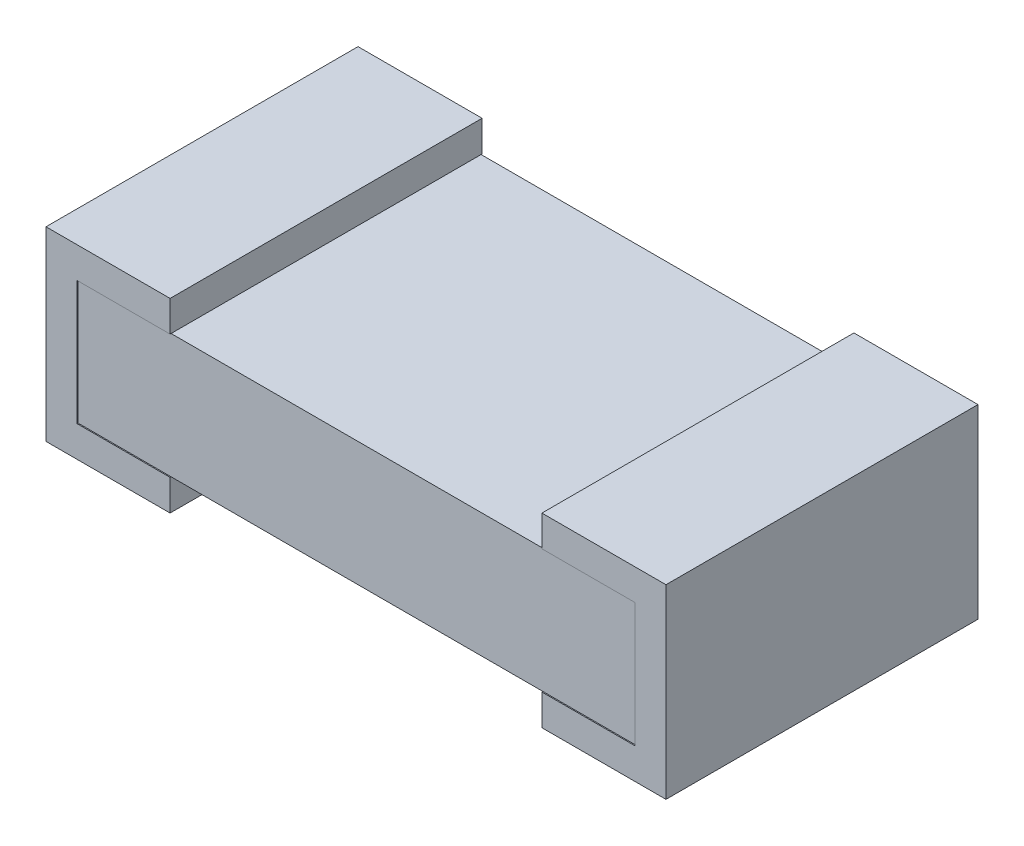
ISO-10303-21;
HEADER;
FILE_DESCRIPTION(('STEP AP214'),'2;1');
FILE_NAME('part.step','',(''),(''),'','','');
FILE_SCHEMA(('AUTOMOTIVE_DESIGN { 1 0 10303 214 1 1 1 1 }'));
ENDSEC;
DATA;
#1=APPLICATION_CONTEXT('core data for automotive mechanical design processes');
#2=APPLICATION_PROTOCOL_DEFINITION('international standard','automotive_design',2000,#1);
#3=PRODUCT_CONTEXT('',#1,'mechanical');
#4=PRODUCT('Part','Part','',(#3));
#5=PRODUCT_RELATED_PRODUCT_CATEGORY('part','',(#4));
#6=PRODUCT_DEFINITION_FORMATION('','',#4);
#7=PRODUCT_DEFINITION_CONTEXT('part definition',#1,'design');
#8=PRODUCT_DEFINITION('design','',#6,#7);
#9=PRODUCT_DEFINITION_SHAPE('','',#8);
#10=(LENGTH_UNIT() NAMED_UNIT(*) SI_UNIT(.MILLI.,.METRE.));
#11=(NAMED_UNIT(*) PLANE_ANGLE_UNIT() SI_UNIT($,.RADIAN.));
#12=(NAMED_UNIT(*) SI_UNIT($,.STERADIAN.) SOLID_ANGLE_UNIT());
#13=UNCERTAINTY_MEASURE_WITH_UNIT(LENGTH_MEASURE(1.E-05),#10,'distance_accuracy_value','');
#14=(GEOMETRIC_REPRESENTATION_CONTEXT(3) GLOBAL_UNCERTAINTY_ASSIGNED_CONTEXT((#13)) GLOBAL_UNIT_ASSIGNED_CONTEXT((#10,
#11,#12)) REPRESENTATION_CONTEXT('',''));
#15=CARTESIAN_POINT('',(0.,0.,0.));
#16=DIRECTION('',(0.,0.,1.));
#17=DIRECTION('',(1.,0.,0.));
#18=AXIS2_PLACEMENT_3D('',#15,#16,#17);
#19=CARTESIAN_POINT('',(-0.686,0.1525,0.381));
#20=DIRECTION('',(0.,-1.,0.));
#21=DIRECTION('',(0.,0.,-1.));
#22=AXIS2_PLACEMENT_3D('',#19,#20,#21);
#23=PLANE('',#22);
#24=DIRECTION('',(-1.,0.,0.));
#25=VECTOR('',#24,1.);
#26=CARTESIAN_POINT('',(-0.686,0.1525,0.381));
#27=LINE('',#26,#25);
#28=CARTESIAN_POINT('',(0.457,0.1525,0.381));
#29=VERTEX_POINT('',#28);
#30=CARTESIAN_POINT('',(-0.457,0.1525,0.381));
#31=VERTEX_POINT('',#30);
#32=EDGE_CURVE('E58',#29,#31,#27,.T.);
#33=ORIENTED_EDGE('',*,*,#32,.F.);
#34=DIRECTION('',(0.,0.,-1.));
#35=VECTOR('',#34,1.);
#36=CARTESIAN_POINT('',(0.457,0.1525,0.3835));
#37=LINE('',#36,#35);
#38=CARTESIAN_POINT('',(0.457,0.1525,-0.381));
#39=VERTEX_POINT('',#38);
#40=EDGE_CURVE('E205',#29,#39,#37,.T.);
#41=ORIENTED_EDGE('',*,*,#40,.T.);
#42=DIRECTION('',(-1.,0.,0.));
#43=VECTOR('',#42,1.);
#44=CARTESIAN_POINT('',(-0.686,0.1525,-0.381));
#45=LINE('',#44,#43);
#46=CARTESIAN_POINT('',(-0.457,0.1525,-0.381));
#47=VERTEX_POINT('',#46);
#48=EDGE_CURVE('E369',#39,#47,#45,.T.);
#49=ORIENTED_EDGE('',*,*,#48,.T.);
#50=DIRECTION('',(0.,0.,-1.));
#51=VECTOR('',#50,1.);
#52=CARTESIAN_POINT('',(-0.457,0.1525,0.3835));
#53=LINE('',#52,#51);
#54=EDGE_CURVE('E328',#31,#47,#53,.T.);
#55=ORIENTED_EDGE('',*,*,#54,.F.);
#56=EDGE_LOOP('',(#33,#41,#49,#55));
#57=FACE_BOUND('',#56,.T.);
#58=ADVANCED_FACE('F34',(#57),#23,.F.);
#59=CARTESIAN_POINT('',(-0.686,-0.1525,0.381));
#60=DIRECTION('',(0.,1.,0.));
#61=DIRECTION('',(0.,0.,1.));
#62=AXIS2_PLACEMENT_3D('',#59,#60,#61);
#63=PLANE('',#62);
#64=DIRECTION('',(1.,0.,0.));
#65=VECTOR('',#64,1.);
#66=CARTESIAN_POINT('',(-0.686,-0.1525,-0.381));
#67=LINE('',#66,#65);
#68=CARTESIAN_POINT('',(-0.457,-0.1525,-0.381));
#69=VERTEX_POINT('',#68);
#70=CARTESIAN_POINT('',(0.457,-0.1525,-0.381));
#71=VERTEX_POINT('',#70);
#72=EDGE_CURVE('E376',#69,#71,#67,.T.);
#73=ORIENTED_EDGE('',*,*,#72,.T.);
#74=DIRECTION('',(0.,0.,-1.));
#75=VECTOR('',#74,1.);
#76=CARTESIAN_POINT('',(0.457,-0.1525,0.3835));
#77=LINE('',#76,#75);
#78=CARTESIAN_POINT('',(0.457,-0.1525,0.381));
#79=VERTEX_POINT('',#78);
#80=EDGE_CURVE('E50',#79,#71,#77,.T.);
#81=ORIENTED_EDGE('',*,*,#80,.F.);
#82=DIRECTION('',(1.,0.,0.));
#83=VECTOR('',#82,1.);
#84=CARTESIAN_POINT('',(-0.686,-0.1525,0.381));
#85=LINE('',#84,#83);
#86=CARTESIAN_POINT('',(-0.457,-0.1525,0.381));
#87=VERTEX_POINT('',#86);
#88=EDGE_CURVE('E42',#87,#79,#85,.T.);
#89=ORIENTED_EDGE('',*,*,#88,.F.);
#90=DIRECTION('',(0.,0.,-1.));
#91=VECTOR('',#90,1.);
#92=CARTESIAN_POINT('',(-0.457,-0.1525,0.3835));
#93=LINE('',#92,#91);
#94=EDGE_CURVE('E341',#87,#69,#93,.T.);
#95=ORIENTED_EDGE('',*,*,#94,.T.);
#96=EDGE_LOOP('',(#73,#81,#89,#95));
#97=FACE_BOUND('',#96,.T.);
#98=ADVANCED_FACE('F392',(#97),#63,.F.);
#99=CARTESIAN_POINT('',(0.686,0.1525,0.381));
#100=DIRECTION('',(0.,0.,-1.));
#101=DIRECTION('',(-1.,0.,0.));
#102=AXIS2_PLACEMENT_3D('',#99,#100,#101);
#103=PLANE('',#102);
#104=DIRECTION('',(0.,1.,0.));
#105=VECTOR('',#104,1.);
#106=CARTESIAN_POINT('',(0.686,-0.1525,0.381));
#107=LINE('',#106,#105);
#108=CARTESIAN_POINT('',(0.686,-0.1525,0.381));
#109=VERTEX_POINT('',#108);
#110=CARTESIAN_POINT('',(0.686,0.1525,0.381));
#111=VERTEX_POINT('',#110);
#112=EDGE_CURVE('E357',#109,#111,#107,.T.);
#113=ORIENTED_EDGE('',*,*,#112,.T.);
#114=EDGE_CURVE('E359',#111,#29,#27,.T.);
#115=ORIENTED_EDGE('',*,*,#114,.T.);
#116=ORIENTED_EDGE('',*,*,#32,.T.);
#117=DIRECTION('',(1.,0.,0.));
#118=VECTOR('',#117,1.);
#119=CARTESIAN_POINT('',(0.686,0.1525,0.381));
#120=LINE('',#119,#118);
#121=CARTESIAN_POINT('',(-0.686,0.1525,0.381));
#122=VERTEX_POINT('',#121);
#123=EDGE_CURVE('E353',#122,#31,#120,.T.);
#124=ORIENTED_EDGE('',*,*,#123,.F.);
#125=DIRECTION('',(0.,-1.,0.));
#126=VECTOR('',#125,1.);
#127=CARTESIAN_POINT('',(-0.686,-0.1525,0.381));
#128=LINE('',#127,#126);
#129=CARTESIAN_POINT('',(-0.686,-0.1525,0.381));
#130=VERTEX_POINT('',#129);
#131=EDGE_CURVE('E361',#122,#130,#128,.T.);
#132=ORIENTED_EDGE('',*,*,#131,.T.);
#133=EDGE_CURVE('E11',#130,#87,#85,.T.);
#134=ORIENTED_EDGE('',*,*,#133,.T.);
#135=ORIENTED_EDGE('',*,*,#88,.T.);
#136=DIRECTION('',(1.,0.,0.));
#137=VECTOR('',#136,1.);
#138=CARTESIAN_POINT('',(0.686,-0.1525,0.381));
#139=LINE('',#138,#137);
#140=EDGE_CURVE('E209',#79,#109,#139,.T.);
#141=ORIENTED_EDGE('',*,*,#140,.T.);
#142=EDGE_LOOP('',(#113,#115,#116,#124,#132,#134,#135,#141));
#143=FACE_BOUND('',#142,.T.);
#144=ADVANCED_FACE('F419',(#143),#103,.F.);
#145=CARTESIAN_POINT('',(0.686,0.1525,-0.381));
#146=DIRECTION('',(0.,0.,-1.));
#147=DIRECTION('',(-1.,0.,0.));
#148=AXIS2_PLACEMENT_3D('',#145,#146,#147);
#149=PLANE('',#148);
#150=DIRECTION('',(0.,1.,0.));
#151=VECTOR('',#150,1.);
#152=CARTESIAN_POINT('',(0.686,-0.1525,-0.381));
#153=LINE('',#152,#151);
#154=CARTESIAN_POINT('',(0.686,-0.1525,-0.381));
#155=VERTEX_POINT('',#154);
#156=CARTESIAN_POINT('',(0.686,0.1525,-0.381));
#157=VERTEX_POINT('',#156);
#158=EDGE_CURVE('E356',#155,#157,#153,.T.);
#159=ORIENTED_EDGE('',*,*,#158,.F.);
#160=EDGE_CURVE('E371',#71,#155,#67,.T.);
#161=ORIENTED_EDGE('',*,*,#160,.F.);
#162=ORIENTED_EDGE('',*,*,#72,.F.);
#163=CARTESIAN_POINT('',(-0.686,-0.1525,-0.381));
#164=VERTEX_POINT('',#163);
#165=EDGE_CURVE('E37',#164,#69,#67,.T.);
#166=ORIENTED_EDGE('',*,*,#165,.F.);
#167=DIRECTION('',(0.,-1.,0.));
#168=VECTOR('',#167,1.);
#169=CARTESIAN_POINT('',(-0.686,-0.1525,-0.381));
#170=LINE('',#169,#168);
#171=CARTESIAN_POINT('',(-0.686,0.1525,-0.381));
#172=VERTEX_POINT('',#171);
#173=EDGE_CURVE('E368',#172,#164,#170,.T.);
#174=ORIENTED_EDGE('',*,*,#173,.F.);
#175=EDGE_CURVE('E365',#47,#172,#45,.T.);
#176=ORIENTED_EDGE('',*,*,#175,.F.);
#177=ORIENTED_EDGE('',*,*,#48,.F.);
#178=EDGE_CURVE('E366',#157,#39,#45,.T.);
#179=ORIENTED_EDGE('',*,*,#178,.F.);
#180=EDGE_LOOP('',(#159,#161,#162,#166,#174,#176,#177,#179));
#181=FACE_BOUND('',#180,.T.);
#182=ADVANCED_FACE('F393',(#181),#149,.T.);
#183=CARTESIAN_POINT('',(-0.686,-0.1525,0.3835));
#184=DIRECTION('',(0.,-1.,0.));
#185=DIRECTION('',(0.,0.,-1.));
#186=AXIS2_PLACEMENT_3D('',#183,#184,#185);
#187=PLANE('',#186);
#188=CARTESIAN_POINT('',(-0.457,-0.1525,0.3835));
#189=VERTEX_POINT('',#188);
#190=EDGE_CURVE('E337',#189,#87,#93,.T.);
#191=ORIENTED_EDGE('',*,*,#190,.T.);
#192=ORIENTED_EDGE('',*,*,#133,.F.);
#193=DIRECTION('',(0.,0.,-1.));
#194=VECTOR('',#193,1.);
#195=CARTESIAN_POINT('',(-0.686,-0.1525,0.3835));
#196=LINE('',#195,#194);
#197=CARTESIAN_POINT('',(-0.686,-0.1525,0.3835));
#198=VERTEX_POINT('',#197);
#199=EDGE_CURVE('E333',#198,#130,#196,.T.);
#200=ORIENTED_EDGE('',*,*,#199,.F.);
#201=DIRECTION('',(-1.,0.,0.));
#202=VECTOR('',#201,1.);
#203=CARTESIAN_POINT('',(-0.686,-0.1525,0.3835));
#204=LINE('',#203,#202);
#205=EDGE_CURVE('E298',#189,#198,#204,.T.);
#206=ORIENTED_EDGE('',*,*,#205,.F.);
#207=EDGE_LOOP('',(#191,#192,#200,#206));
#208=FACE_BOUND('',#207,.T.);
#209=ADVANCED_FACE('F424',(#208),#187,.F.);
#210=CARTESIAN_POINT('',(-0.686,0.1525,0.3835));
#211=DIRECTION('',(-1.,0.,0.));
#212=DIRECTION('',(0.,0.,1.));
#213=AXIS2_PLACEMENT_3D('',#210,#211,#212);
#214=PLANE('',#213);
#215=ORIENTED_EDGE('',*,*,#199,.T.);
#216=ORIENTED_EDGE('',*,*,#131,.F.);
#217=DIRECTION('',(0.,0.,-1.));
#218=VECTOR('',#217,1.);
#219=CARTESIAN_POINT('',(-0.686,0.1525,0.3835));
#220=LINE('',#219,#218);
#221=CARTESIAN_POINT('',(-0.686,0.1525,0.3835));
#222=VERTEX_POINT('',#221);
#223=EDGE_CURVE('E329',#222,#122,#220,.T.);
#224=ORIENTED_EDGE('',*,*,#223,.F.);
#225=DIRECTION('',(0.,1.,0.));
#226=VECTOR('',#225,1.);
#227=CARTESIAN_POINT('',(-0.686,0.1525,0.3835));
#228=LINE('',#227,#226);
#229=EDGE_CURVE('E300',#198,#222,#228,.T.);
#230=ORIENTED_EDGE('',*,*,#229,.F.);
#231=EDGE_LOOP('',(#215,#216,#224,#230));
#232=FACE_BOUND('',#231,.T.);
#233=ADVANCED_FACE('F428',(#232),#214,.F.);
#234=CARTESIAN_POINT('',(-0.457,0.1525,0.3835));
#235=DIRECTION('',(0.,1.,0.));
#236=DIRECTION('',(0.,0.,1.));
#237=AXIS2_PLACEMENT_3D('',#234,#235,#236);
#238=PLANE('',#237);
#239=ORIENTED_EDGE('',*,*,#223,.T.);
#240=ORIENTED_EDGE('',*,*,#123,.T.);
#241=CARTESIAN_POINT('',(-0.457,0.1525,0.3835));
#242=VERTEX_POINT('',#241);
#243=EDGE_CURVE('E324',#242,#31,#53,.T.);
#244=ORIENTED_EDGE('',*,*,#243,.F.);
#245=DIRECTION('',(1.,0.,0.));
#246=VECTOR('',#245,1.);
#247=CARTESIAN_POINT('',(-0.457,0.1525,0.3835));
#248=LINE('',#247,#246);
#249=EDGE_CURVE('E302',#222,#242,#248,.T.);
#250=ORIENTED_EDGE('',*,*,#249,.F.);
#251=EDGE_LOOP('',(#239,#240,#244,#250));
#252=FACE_BOUND('',#251,.T.);
#253=ADVANCED_FACE('F454',(#252),#238,.F.);
#254=CARTESIAN_POINT('',(-0.457,0.2285,0.3835));
#255=DIRECTION('',(-1.,0.,0.));
#256=DIRECTION('',(0.,-1.,0.));
#257=AXIS2_PLACEMENT_3D('',#254,#255,#256);
#258=PLANE('',#257);
#259=DIRECTION('',(0.,1.,0.));
#260=VECTOR('',#259,1.);
#261=CARTESIAN_POINT('',(-0.457,0.2285,-0.3835));
#262=LINE('',#261,#260);
#263=CARTESIAN_POINT('',(-0.457,0.1525,-0.3835));
#264=VERTEX_POINT('',#263);
#265=CARTESIAN_POINT('',(-0.457,0.2285,-0.3835));
#266=VERTEX_POINT('',#265);
#267=EDGE_CURVE('E285',#264,#266,#262,.T.);
#268=ORIENTED_EDGE('',*,*,#267,.T.);
#269=DIRECTION('',(0.,0.,-1.));
#270=VECTOR('',#269,1.);
#271=CARTESIAN_POINT('',(-0.457,0.2285,0.3835));
#272=LINE('',#271,#270);
#273=CARTESIAN_POINT('',(-0.457,0.2285,0.3835));
#274=VERTEX_POINT('',#273);
#275=EDGE_CURVE('E350',#274,#266,#272,.T.);
#276=ORIENTED_EDGE('',*,*,#275,.F.);
#277=DIRECTION('',(0.,1.,0.));
#278=VECTOR('',#277,1.);
#279=CARTESIAN_POINT('',(-0.457,0.2285,0.3835));
#280=LINE('',#279,#278);
#281=EDGE_CURVE('E286',#242,#274,#280,.T.);
#282=ORIENTED_EDGE('',*,*,#281,.F.);
#283=ORIENTED_EDGE('',*,*,#243,.T.);
#284=ORIENTED_EDGE('',*,*,#54,.T.);
#285=EDGE_CURVE('E304',#47,#264,#53,.T.);
#286=ORIENTED_EDGE('',*,*,#285,.T.);
#287=EDGE_LOOP('',(#268,#276,#282,#283,#284,#286));
#288=FACE_BOUND('',#287,.T.);
#289=ADVANCED_FACE('F456',(#288),#258,.F.);
#290=CARTESIAN_POINT('',(-0.762,0.2285,0.3835));
#291=DIRECTION('',(0.,-1.,0.));
#292=DIRECTION('',(0.,0.,-1.));
#293=AXIS2_PLACEMENT_3D('',#290,#291,#292);
#294=PLANE('',#293);
#295=DIRECTION('',(-1.,0.,0.));
#296=VECTOR('',#295,1.);
#297=CARTESIAN_POINT('',(-0.762,0.2285,-0.3835));
#298=LINE('',#297,#296);
#299=CARTESIAN_POINT('',(-0.762,0.2285,-0.3835));
#300=VERTEX_POINT('',#299);
#301=EDGE_CURVE('E307',#266,#300,#298,.T.);
#302=ORIENTED_EDGE('',*,*,#301,.T.);
#303=DIRECTION('',(0.,0.,-1.));
#304=VECTOR('',#303,1.);
#305=CARTESIAN_POINT('',(-0.762,0.2285,0.3835));
#306=LINE('',#305,#304);
#307=CARTESIAN_POINT('',(-0.762,0.2285,0.3835));
#308=VERTEX_POINT('',#307);
#309=EDGE_CURVE('E347',#308,#300,#306,.T.);
#310=ORIENTED_EDGE('',*,*,#309,.F.);
#311=DIRECTION('',(-1.,0.,0.));
#312=VECTOR('',#311,1.);
#313=CARTESIAN_POINT('',(-0.762,0.2285,0.3835));
#314=LINE('',#313,#312);
#315=EDGE_CURVE('E289',#274,#308,#314,.T.);
#316=ORIENTED_EDGE('',*,*,#315,.F.);
#317=ORIENTED_EDGE('',*,*,#275,.T.);
#318=EDGE_LOOP('',(#302,#310,#316,#317));
#319=FACE_BOUND('',#318,.T.);
#320=ADVANCED_FACE('F462',(#319),#294,.F.);
#321=CARTESIAN_POINT('',(-0.762,-0.2285,0.3835));
#322=DIRECTION('',(1.,0.,0.));
#323=DIRECTION('',(0.,0.,-1.));
#324=AXIS2_PLACEMENT_3D('',#321,#322,#323);
#325=PLANE('',#324);
#326=DIRECTION('',(0.,-1.,0.));
#327=VECTOR('',#326,1.);
#328=CARTESIAN_POINT('',(-0.762,-0.2285,-0.3835));
#329=LINE('',#328,#327);
#330=CARTESIAN_POINT('',(-0.762,-0.2285,-0.3835));
#331=VERTEX_POINT('',#330);
#332=EDGE_CURVE('E309',#300,#331,#329,.T.);
#333=ORIENTED_EDGE('',*,*,#332,.T.);
#334=DIRECTION('',(0.,0.,-1.));
#335=VECTOR('',#334,1.);
#336=CARTESIAN_POINT('',(-0.762,-0.2285,0.3835));
#337=LINE('',#336,#335);
#338=CARTESIAN_POINT('',(-0.762,-0.2285,0.3835));
#339=VERTEX_POINT('',#338);
#340=EDGE_CURVE('E344',#339,#331,#337,.T.);
#341=ORIENTED_EDGE('',*,*,#340,.F.);
#342=DIRECTION('',(0.,-1.,0.));
#343=VECTOR('',#342,1.);
#344=CARTESIAN_POINT('',(-0.762,-0.2285,0.3835));
#345=LINE('',#344,#343);
#346=EDGE_CURVE('E292',#308,#339,#345,.T.);
#347=ORIENTED_EDGE('',*,*,#346,.F.);
#348=ORIENTED_EDGE('',*,*,#309,.T.);
#349=EDGE_LOOP('',(#333,#341,#347,#348));
#350=FACE_BOUND('',#349,.T.);
#351=ADVANCED_FACE('F464',(#350),#325,.F.);
#352=CARTESIAN_POINT('',(-0.457,-0.2285,0.3835));
#353=DIRECTION('',(0.,1.,0.));
#354=DIRECTION('',(-1.,0.,0.));
#355=AXIS2_PLACEMENT_3D('',#352,#353,#354);
#356=PLANE('',#355);
#357=DIRECTION('',(1.,0.,0.));
#358=VECTOR('',#357,1.);
#359=CARTESIAN_POINT('',(-0.457,-0.2285,-0.3835));
#360=LINE('',#359,#358);
#361=CARTESIAN_POINT('',(-0.457,-0.2285,-0.3835));
#362=VERTEX_POINT('',#361);
#363=EDGE_CURVE('E311',#331,#362,#360,.T.);
#364=ORIENTED_EDGE('',*,*,#363,.T.);
#365=DIRECTION('',(0.,0.,-1.));
#366=VECTOR('',#365,1.);
#367=CARTESIAN_POINT('',(-0.457,-0.2285,0.3835));
#368=LINE('',#367,#366);
#369=CARTESIAN_POINT('',(-0.457,-0.2285,0.3835));
#370=VERTEX_POINT('',#369);
#371=EDGE_CURVE('E340',#370,#362,#368,.T.);
#372=ORIENTED_EDGE('',*,*,#371,.F.);
#373=DIRECTION('',(1.,0.,0.));
#374=VECTOR('',#373,1.);
#375=CARTESIAN_POINT('',(-0.457,-0.2285,0.3835));
#376=LINE('',#375,#374);
#377=EDGE_CURVE('E294',#339,#370,#376,.T.);
#378=ORIENTED_EDGE('',*,*,#377,.F.);
#379=ORIENTED_EDGE('',*,*,#340,.T.);
#380=EDGE_LOOP('',(#364,#372,#378,#379));
#381=FACE_BOUND('',#380,.T.);
#382=ADVANCED_FACE('F465',(#381),#356,.F.);
#383=CARTESIAN_POINT('',(-0.457,-0.1525,0.3835));
#384=DIRECTION('',(-1.,0.,0.));
#385=DIRECTION('',(0.,-1.,0.));
#386=AXIS2_PLACEMENT_3D('',#383,#384,#385);
#387=PLANE('',#386);
#388=DIRECTION('',(0.,1.,0.));
#389=VECTOR('',#388,1.);
#390=CARTESIAN_POINT('',(-0.457,-0.1525,-0.3835));
#391=LINE('',#390,#389);
#392=CARTESIAN_POINT('',(-0.457,-0.1525,-0.3835));
#393=VERTEX_POINT('',#392);
#394=EDGE_CURVE('E313',#362,#393,#391,.T.);
#395=ORIENTED_EDGE('',*,*,#394,.T.);
#396=EDGE_CURVE('E336',#69,#393,#93,.T.);
#397=ORIENTED_EDGE('',*,*,#396,.F.);
#398=ORIENTED_EDGE('',*,*,#94,.F.);
#399=ORIENTED_EDGE('',*,*,#190,.F.);
#400=DIRECTION('',(0.,1.,0.));
#401=VECTOR('',#400,1.);
#402=CARTESIAN_POINT('',(-0.457,-0.1525,0.3835));
#403=LINE('',#402,#401);
#404=EDGE_CURVE('E296',#370,#189,#403,.T.);
#405=ORIENTED_EDGE('',*,*,#404,.F.);
#406=ORIENTED_EDGE('',*,*,#371,.T.);
#407=EDGE_LOOP('',(#395,#397,#398,#399,#405,#406));
#408=FACE_BOUND('',#407,.T.);
#409=ADVANCED_FACE('F388',(#408),#387,.F.);
#410=ORIENTED_EDGE('',*,*,#165,.T.);
#411=ORIENTED_EDGE('',*,*,#396,.T.);
#412=DIRECTION('',(-1.,0.,0.));
#413=VECTOR('',#412,1.);
#414=CARTESIAN_POINT('',(-0.686,-0.1525,-0.3835));
#415=LINE('',#414,#413);
#416=CARTESIAN_POINT('',(-0.686,-0.1525,-0.3835));
#417=VERTEX_POINT('',#416);
#418=EDGE_CURVE('E316',#393,#417,#415,.T.);
#419=ORIENTED_EDGE('',*,*,#418,.T.);
#420=EDGE_CURVE('E332',#164,#417,#196,.T.);
#421=ORIENTED_EDGE('',*,*,#420,.F.);
#422=EDGE_LOOP('',(#410,#411,#419,#421));
#423=FACE_BOUND('',#422,.T.);
#424=ADVANCED_FACE('F383',(#423),#187,.F.);
#425=ORIENTED_EDGE('',*,*,#173,.T.);
#426=ORIENTED_EDGE('',*,*,#420,.T.);
#427=DIRECTION('',(0.,1.,0.));
#428=VECTOR('',#427,1.);
#429=CARTESIAN_POINT('',(-0.686,0.1525,-0.3835));
#430=LINE('',#429,#428);
#431=CARTESIAN_POINT('',(-0.686,0.1525,-0.3835));
#432=VERTEX_POINT('',#431);
#433=EDGE_CURVE('E319',#417,#432,#430,.T.);
#434=ORIENTED_EDGE('',*,*,#433,.T.);
#435=EDGE_CURVE('E327',#172,#432,#220,.T.);
#436=ORIENTED_EDGE('',*,*,#435,.F.);
#437=EDGE_LOOP('',(#425,#426,#434,#436));
#438=FACE_BOUND('',#437,.T.);
#439=ADVANCED_FACE('F445',(#438),#214,.F.);
#440=ORIENTED_EDGE('',*,*,#175,.T.);
#441=ORIENTED_EDGE('',*,*,#435,.T.);
#442=DIRECTION('',(1.,0.,0.));
#443=VECTOR('',#442,1.);
#444=CARTESIAN_POINT('',(-0.457,0.1525,-0.3835));
#445=LINE('',#444,#443);
#446=EDGE_CURVE('E290',#432,#264,#445,.T.);
#447=ORIENTED_EDGE('',*,*,#446,.T.);
#448=ORIENTED_EDGE('',*,*,#285,.F.);
#449=EDGE_LOOP('',(#440,#441,#447,#448));
#450=FACE_BOUND('',#449,.T.);
#451=ADVANCED_FACE('F448',(#450),#238,.F.);
#452=CARTESIAN_POINT('',(-0.457,0.1525,0.3835));
#453=DIRECTION('',(0.,0.,-1.));
#454=DIRECTION('',(-1.,0.,0.));
#455=AXIS2_PLACEMENT_3D('',#452,#453,#454);
#456=PLANE('',#455);
#457=ORIENTED_EDGE('',*,*,#281,.T.);
#458=ORIENTED_EDGE('',*,*,#315,.T.);
#459=ORIENTED_EDGE('',*,*,#346,.T.);
#460=ORIENTED_EDGE('',*,*,#377,.T.);
#461=ORIENTED_EDGE('',*,*,#404,.T.);
#462=ORIENTED_EDGE('',*,*,#205,.T.);
#463=ORIENTED_EDGE('',*,*,#229,.T.);
#464=ORIENTED_EDGE('',*,*,#249,.T.);
#465=EDGE_LOOP('',(#457,#458,#459,#460,#461,#462,#463,#464));
#466=FACE_BOUND('',#465,.T.);
#467=ADVANCED_FACE('F432',(#466),#456,.F.);
#468=CARTESIAN_POINT('',(-0.457,0.1525,-0.3835));
#469=DIRECTION('',(0.,0.,-1.));
#470=DIRECTION('',(-1.,0.,0.));
#471=AXIS2_PLACEMENT_3D('',#468,#469,#470);
#472=PLANE('',#471);
#473=ORIENTED_EDGE('',*,*,#267,.F.);
#474=ORIENTED_EDGE('',*,*,#446,.F.);
#475=ORIENTED_EDGE('',*,*,#433,.F.);
#476=ORIENTED_EDGE('',*,*,#418,.F.);
#477=ORIENTED_EDGE('',*,*,#394,.F.);
#478=ORIENTED_EDGE('',*,*,#363,.F.);
#479=ORIENTED_EDGE('',*,*,#332,.F.);
#480=ORIENTED_EDGE('',*,*,#301,.F.);
#481=EDGE_LOOP('',(#473,#474,#475,#476,#477,#478,#479,#480));
#482=FACE_BOUND('',#481,.T.);
#483=ADVANCED_FACE('F441',(#482),#472,.T.);
#484=CARTESIAN_POINT('',(0.457,0.1525,0.3835));
#485=DIRECTION('',(0.,-1.,0.));
#486=DIRECTION('',(0.,0.,-1.));
#487=AXIS2_PLACEMENT_3D('',#484,#485,#486);
#488=PLANE('',#487);
#489=ORIENTED_EDGE('',*,*,#114,.F.);
#490=DIRECTION('',(0.,0.,-1.));
#491=VECTOR('',#490,1.);
#492=CARTESIAN_POINT('',(0.686,0.1525,0.3835));
#493=LINE('',#492,#491);
#494=CARTESIAN_POINT('',(0.686,0.1525,0.3835));
#495=VERTEX_POINT('',#494);
#496=EDGE_CURVE('E225',#495,#111,#493,.T.);
#497=ORIENTED_EDGE('',*,*,#496,.F.);
#498=DIRECTION('',(-1.,0.,0.));
#499=VECTOR('',#498,1.);
#500=CARTESIAN_POINT('',(0.457,0.1525,0.3835));
#501=LINE('',#500,#499);
#502=CARTESIAN_POINT('',(0.457,0.1525,0.3835));
#503=VERTEX_POINT('',#502);
#504=EDGE_CURVE('E216',#495,#503,#501,.T.);
#505=ORIENTED_EDGE('',*,*,#504,.T.);
#506=EDGE_CURVE('E198',#503,#29,#37,.T.);
#507=ORIENTED_EDGE('',*,*,#506,.T.);
#508=EDGE_LOOP('',(#489,#497,#505,#507));
#509=FACE_BOUND('',#508,.T.);
#510=ADVANCED_FACE('F223',(#509),#488,.T.);
#511=CARTESIAN_POINT('',(0.686,0.1525,0.3835));
#512=DIRECTION('',(-1.,0.,0.));
#513=DIRECTION('',(0.,0.,1.));
#514=AXIS2_PLACEMENT_3D('',#511,#512,#513);
#515=PLANE('',#514);
#516=ORIENTED_EDGE('',*,*,#112,.F.);
#517=DIRECTION('',(0.,0.,-1.));
#518=VECTOR('',#517,1.);
#519=CARTESIAN_POINT('',(0.686,-0.1525,0.3835));
#520=LINE('',#519,#518);
#521=CARTESIAN_POINT('',(0.686,-0.1525,0.3835));
#522=VERTEX_POINT('',#521);
#523=EDGE_CURVE('E279',#522,#109,#520,.T.);
#524=ORIENTED_EDGE('',*,*,#523,.F.);
#525=DIRECTION('',(0.,1.,0.));
#526=VECTOR('',#525,1.);
#527=CARTESIAN_POINT('',(0.686,0.1525,0.3835));
#528=LINE('',#527,#526);
#529=EDGE_CURVE('E226',#522,#495,#528,.T.);
#530=ORIENTED_EDGE('',*,*,#529,.T.);
#531=ORIENTED_EDGE('',*,*,#496,.T.);
#532=EDGE_LOOP('',(#516,#524,#530,#531));
#533=FACE_BOUND('',#532,.T.);
#534=ADVANCED_FACE('F417',(#533),#515,.T.);
#535=CARTESIAN_POINT('',(0.686,-0.1525,0.3835));
#536=DIRECTION('',(0.,1.,0.));
#537=DIRECTION('',(0.,0.,1.));
#538=AXIS2_PLACEMENT_3D('',#535,#536,#537);
#539=PLANE('',#538);
#540=ORIENTED_EDGE('',*,*,#140,.F.);
#541=CARTESIAN_POINT('',(0.457,-0.1525,0.3835));
#542=VERTEX_POINT('',#541);
#543=EDGE_CURVE('E275',#542,#79,#77,.T.);
#544=ORIENTED_EDGE('',*,*,#543,.F.);
#545=DIRECTION('',(1.,0.,0.));
#546=VECTOR('',#545,1.);
#547=CARTESIAN_POINT('',(0.686,-0.1525,0.3835));
#548=LINE('',#547,#546);
#549=EDGE_CURVE('E228',#542,#522,#548,.T.);
#550=ORIENTED_EDGE('',*,*,#549,.T.);
#551=ORIENTED_EDGE('',*,*,#523,.T.);
#552=EDGE_LOOP('',(#540,#544,#550,#551));
#553=FACE_BOUND('',#552,.T.);
#554=ADVANCED_FACE('F413',(#553),#539,.T.);
#555=CARTESIAN_POINT('',(0.457,0.2285,0.3835));
#556=DIRECTION('',(-1.,0.,0.));
#557=DIRECTION('',(0.,-1.,0.));
#558=AXIS2_PLACEMENT_3D('',#555,#556,#557);
#559=PLANE('',#558);
#560=DIRECTION('',(0.,1.,0.));
#561=VECTOR('',#560,1.);
#562=CARTESIAN_POINT('',(0.457,0.2285,-0.3835));
#563=LINE('',#562,#561);
#564=CARTESIAN_POINT('',(0.457,0.1525,-0.3835));
#565=VERTEX_POINT('',#564);
#566=CARTESIAN_POINT('',(0.457,0.2285,-0.3835));
#567=VERTEX_POINT('',#566);
#568=EDGE_CURVE('E244',#565,#567,#563,.T.);
#569=ORIENTED_EDGE('',*,*,#568,.F.);
#570=EDGE_CURVE('E211',#39,#565,#37,.T.);
#571=ORIENTED_EDGE('',*,*,#570,.F.);
#572=ORIENTED_EDGE('',*,*,#40,.F.);
#573=ORIENTED_EDGE('',*,*,#506,.F.);
#574=DIRECTION('',(0.,1.,0.));
#575=VECTOR('',#574,1.);
#576=CARTESIAN_POINT('',(0.457,0.2285,0.3835));
#577=LINE('',#576,#575);
#578=CARTESIAN_POINT('',(0.457,0.2285,0.3835));
#579=VERTEX_POINT('',#578);
#580=EDGE_CURVE('E202',#503,#579,#577,.T.);
#581=ORIENTED_EDGE('',*,*,#580,.T.);
#582=DIRECTION('',(0.,0.,-1.));
#583=VECTOR('',#582,1.);
#584=CARTESIAN_POINT('',(0.457,0.2285,0.3835));
#585=LINE('',#584,#583);
#586=EDGE_CURVE('E243',#579,#567,#585,.T.);
#587=ORIENTED_EDGE('',*,*,#586,.T.);
#588=EDGE_LOOP('',(#569,#571,#572,#573,#581,#587));
#589=FACE_BOUND('',#588,.T.);
#590=ADVANCED_FACE('F201',(#589),#559,.T.);
#591=CARTESIAN_POINT('',(0.686,0.1525,-0.3835));
#592=VERTEX_POINT('',#591);
#593=EDGE_CURVE('E282',#157,#592,#493,.T.);
#594=ORIENTED_EDGE('',*,*,#593,.F.);
#595=ORIENTED_EDGE('',*,*,#178,.T.);
#596=ORIENTED_EDGE('',*,*,#570,.T.);
#597=DIRECTION('',(-1.,0.,0.));
#598=VECTOR('',#597,1.);
#599=CARTESIAN_POINT('',(0.457,0.1525,-0.3835));
#600=LINE('',#599,#598);
#601=EDGE_CURVE('E247',#592,#565,#600,.T.);
#602=ORIENTED_EDGE('',*,*,#601,.F.);
#603=EDGE_LOOP('',(#594,#595,#596,#602));
#604=FACE_BOUND('',#603,.T.);
#605=ADVANCED_FACE('F401',(#604),#488,.T.);
#606=CARTESIAN_POINT('',(0.686,-0.1525,-0.3835));
#607=VERTEX_POINT('',#606);
#608=EDGE_CURVE('E278',#155,#607,#520,.T.);
#609=ORIENTED_EDGE('',*,*,#608,.F.);
#610=ORIENTED_EDGE('',*,*,#158,.T.);
#611=ORIENTED_EDGE('',*,*,#593,.T.);
#612=DIRECTION('',(0.,1.,0.));
#613=VECTOR('',#612,1.);
#614=CARTESIAN_POINT('',(0.686,0.1525,-0.3835));
#615=LINE('',#614,#613);
#616=EDGE_CURVE('E250',#607,#592,#615,.T.);
#617=ORIENTED_EDGE('',*,*,#616,.F.);
#618=EDGE_LOOP('',(#609,#610,#611,#617));
#619=FACE_BOUND('',#618,.T.);
#620=ADVANCED_FACE('F397',(#619),#515,.T.);
#621=CARTESIAN_POINT('',(0.457,-0.1525,-0.3835));
#622=VERTEX_POINT('',#621);
#623=EDGE_CURVE('E274',#71,#622,#77,.T.);
#624=ORIENTED_EDGE('',*,*,#623,.F.);
#625=ORIENTED_EDGE('',*,*,#160,.T.);
#626=ORIENTED_EDGE('',*,*,#608,.T.);
#627=DIRECTION('',(1.,0.,0.));
#628=VECTOR('',#627,1.);
#629=CARTESIAN_POINT('',(0.686,-0.1525,-0.3835));
#630=LINE('',#629,#628);
#631=EDGE_CURVE('E253',#622,#607,#630,.T.);
#632=ORIENTED_EDGE('',*,*,#631,.F.);
#633=EDGE_LOOP('',(#624,#625,#626,#632));
#634=FACE_BOUND('',#633,.T.);
#635=ADVANCED_FACE('F406',(#634),#539,.T.);
#636=CARTESIAN_POINT('',(0.457,-0.1525,0.3835));
#637=DIRECTION('',(-1.,0.,0.));
#638=DIRECTION('',(0.,-1.,0.));
#639=AXIS2_PLACEMENT_3D('',#636,#637,#638);
#640=PLANE('',#639);
#641=DIRECTION('',(0.,1.,0.));
#642=VECTOR('',#641,1.);
#643=CARTESIAN_POINT('',(0.457,-0.1525,-0.3835));
#644=LINE('',#643,#642);
#645=CARTESIAN_POINT('',(0.457,-0.2285,-0.3835));
#646=VERTEX_POINT('',#645);
#647=EDGE_CURVE('E256',#646,#622,#644,.T.);
#648=ORIENTED_EDGE('',*,*,#647,.F.);
#649=DIRECTION('',(0.,0.,-1.));
#650=VECTOR('',#649,1.);
#651=CARTESIAN_POINT('',(0.457,-0.2285,0.3835));
#652=LINE('',#651,#650);
#653=CARTESIAN_POINT('',(0.457,-0.2285,0.3835));
#654=VERTEX_POINT('',#653);
#655=EDGE_CURVE('E272',#654,#646,#652,.T.);
#656=ORIENTED_EDGE('',*,*,#655,.F.);
#657=DIRECTION('',(0.,1.,0.));
#658=VECTOR('',#657,1.);
#659=CARTESIAN_POINT('',(0.457,-0.1525,0.3835));
#660=LINE('',#659,#658);
#661=EDGE_CURVE('E233',#654,#542,#660,.T.);
#662=ORIENTED_EDGE('',*,*,#661,.T.);
#663=ORIENTED_EDGE('',*,*,#543,.T.);
#664=ORIENTED_EDGE('',*,*,#80,.T.);
#665=ORIENTED_EDGE('',*,*,#623,.T.);
#666=EDGE_LOOP('',(#648,#656,#662,#663,#664,#665));
#667=FACE_BOUND('',#666,.T.);
#668=ADVANCED_FACE('F408',(#667),#640,.T.);
#669=CARTESIAN_POINT('',(0.457,-0.2285,0.3835));
#670=DIRECTION('',(0.,-1.,0.));
#671=DIRECTION('',(1.,0.,0.));
#672=AXIS2_PLACEMENT_3D('',#669,#670,#671);
#673=PLANE('',#672);
#674=DIRECTION('',(-1.,0.,0.));
#675=VECTOR('',#674,1.);
#676=CARTESIAN_POINT('',(0.457,-0.2285,-0.3835));
#677=LINE('',#676,#675);
#678=CARTESIAN_POINT('',(0.762,-0.2285,-0.3835));
#679=VERTEX_POINT('',#678);
#680=EDGE_CURVE('E259',#679,#646,#677,.T.);
#681=ORIENTED_EDGE('',*,*,#680,.F.);
#682=DIRECTION('',(0.,0.,-1.));
#683=VECTOR('',#682,1.);
#684=CARTESIAN_POINT('',(0.762,-0.2285,0.3835));
#685=LINE('',#684,#683);
#686=CARTESIAN_POINT('',(0.762,-0.2285,0.3835));
#687=VERTEX_POINT('',#686);
#688=EDGE_CURVE('E270',#687,#679,#685,.T.);
#689=ORIENTED_EDGE('',*,*,#688,.F.);
#690=DIRECTION('',(-1.,0.,0.));
#691=VECTOR('',#690,1.);
#692=CARTESIAN_POINT('',(0.457,-0.2285,0.3835));
#693=LINE('',#692,#691);
#694=EDGE_CURVE('E236',#687,#654,#693,.T.);
#695=ORIENTED_EDGE('',*,*,#694,.T.);
#696=ORIENTED_EDGE('',*,*,#655,.T.);
#697=EDGE_LOOP('',(#681,#689,#695,#696));
#698=FACE_BOUND('',#697,.T.);
#699=ADVANCED_FACE('F641',(#698),#673,.T.);
#700=CARTESIAN_POINT('',(0.762,-0.2285,0.3835));
#701=DIRECTION('',(1.,0.,0.));
#702=DIRECTION('',(0.,0.,-1.));
#703=AXIS2_PLACEMENT_3D('',#700,#701,#702);
#704=PLANE('',#703);
#705=DIRECTION('',(0.,-1.,0.));
#706=VECTOR('',#705,1.);
#707=CARTESIAN_POINT('',(0.762,-0.2285,-0.3835));
#708=LINE('',#707,#706);
#709=CARTESIAN_POINT('',(0.762,0.2285,-0.3835));
#710=VERTEX_POINT('',#709);
#711=EDGE_CURVE('E262',#710,#679,#708,.T.);
#712=ORIENTED_EDGE('',*,*,#711,.F.);
#713=DIRECTION('',(0.,0.,-1.));
#714=VECTOR('',#713,1.);
#715=CARTESIAN_POINT('',(0.762,0.2285,0.3835));
#716=LINE('',#715,#714);
#717=CARTESIAN_POINT('',(0.762,0.2285,0.3835));
#718=VERTEX_POINT('',#717);
#719=EDGE_CURVE('E268',#718,#710,#716,.T.);
#720=ORIENTED_EDGE('',*,*,#719,.F.);
#721=DIRECTION('',(0.,-1.,0.));
#722=VECTOR('',#721,1.);
#723=CARTESIAN_POINT('',(0.762,-0.2285,0.3835));
#724=LINE('',#723,#722);
#725=EDGE_CURVE('E239',#718,#687,#724,.T.);
#726=ORIENTED_EDGE('',*,*,#725,.T.);
#727=ORIENTED_EDGE('',*,*,#688,.T.);
#728=EDGE_LOOP('',(#712,#720,#726,#727));
#729=FACE_BOUND('',#728,.T.);
#730=ADVANCED_FACE('F651',(#729),#704,.T.);
#731=CARTESIAN_POINT('',(0.762,0.2285,0.3835));
#732=DIRECTION('',(0.,1.,0.));
#733=DIRECTION('',(0.,0.,1.));
#734=AXIS2_PLACEMENT_3D('',#731,#732,#733);
#735=PLANE('',#734);
#736=DIRECTION('',(1.,0.,0.));
#737=VECTOR('',#736,1.);
#738=CARTESIAN_POINT('',(0.762,0.2285,-0.3835));
#739=LINE('',#738,#737);
#740=EDGE_CURVE('E221',#567,#710,#739,.T.);
#741=ORIENTED_EDGE('',*,*,#740,.F.);
#742=ORIENTED_EDGE('',*,*,#586,.F.);
#743=DIRECTION('',(1.,0.,0.));
#744=VECTOR('',#743,1.);
#745=CARTESIAN_POINT('',(0.762,0.2285,0.3835));
#746=LINE('',#745,#744);
#747=EDGE_CURVE('E220',#579,#718,#746,.T.);
#748=ORIENTED_EDGE('',*,*,#747,.T.);
#749=ORIENTED_EDGE('',*,*,#719,.T.);
#750=EDGE_LOOP('',(#741,#742,#748,#749));
#751=FACE_BOUND('',#750,.T.);
#752=ADVANCED_FACE('F662',(#751),#735,.T.);
#753=CARTESIAN_POINT('',(0.457,0.1525,0.3835));
#754=DIRECTION('',(0.,0.,-1.));
#755=DIRECTION('',(1.,0.,0.));
#756=AXIS2_PLACEMENT_3D('',#753,#754,#755);
#757=PLANE('',#756);
#758=ORIENTED_EDGE('',*,*,#580,.F.);
#759=ORIENTED_EDGE('',*,*,#504,.F.);
#760=ORIENTED_EDGE('',*,*,#529,.F.);
#761=ORIENTED_EDGE('',*,*,#549,.F.);
#762=ORIENTED_EDGE('',*,*,#661,.F.);
#763=ORIENTED_EDGE('',*,*,#694,.F.);
#764=ORIENTED_EDGE('',*,*,#725,.F.);
#765=ORIENTED_EDGE('',*,*,#747,.F.);
#766=EDGE_LOOP('',(#758,#759,#760,#761,#762,#763,#764,#765));
#767=FACE_BOUND('',#766,.T.);
#768=ADVANCED_FACE('F214',(#767),#757,.F.);
#769=CARTESIAN_POINT('',(0.457,0.1525,-0.3835));
#770=DIRECTION('',(0.,0.,-1.));
#771=DIRECTION('',(1.,0.,0.));
#772=AXIS2_PLACEMENT_3D('',#769,#770,#771);
#773=PLANE('',#772);
#774=ORIENTED_EDGE('',*,*,#568,.T.);
#775=ORIENTED_EDGE('',*,*,#740,.T.);
#776=ORIENTED_EDGE('',*,*,#711,.T.);
#777=ORIENTED_EDGE('',*,*,#680,.T.);
#778=ORIENTED_EDGE('',*,*,#647,.T.);
#779=ORIENTED_EDGE('',*,*,#631,.T.);
#780=ORIENTED_EDGE('',*,*,#616,.T.);
#781=ORIENTED_EDGE('',*,*,#601,.T.);
#782=EDGE_LOOP('',(#774,#775,#776,#777,#778,#779,#780,#781));
#783=FACE_BOUND('',#782,.T.);
#784=ADVANCED_FACE('F403',(#783),#773,.T.);
#785=CLOSED_SHELL('',(#58,#98,#144,#182,#209,#233,#253,#289,#320,#351,#382,#409,#424,#439,#451,
#467,#483,#510,#534,#554,#590,#605,#620,#635,#668,#699,#730,#752,#768,#784));
#786=MANIFOLD_SOLID_BREP('B2',#785);
#787=ADVANCED_BREP_SHAPE_REPRESENTATION('',(#18,#786),#14);
#788=SHAPE_DEFINITION_REPRESENTATION(#9,#787);
ENDSEC;
END-ISO-10303-21;
